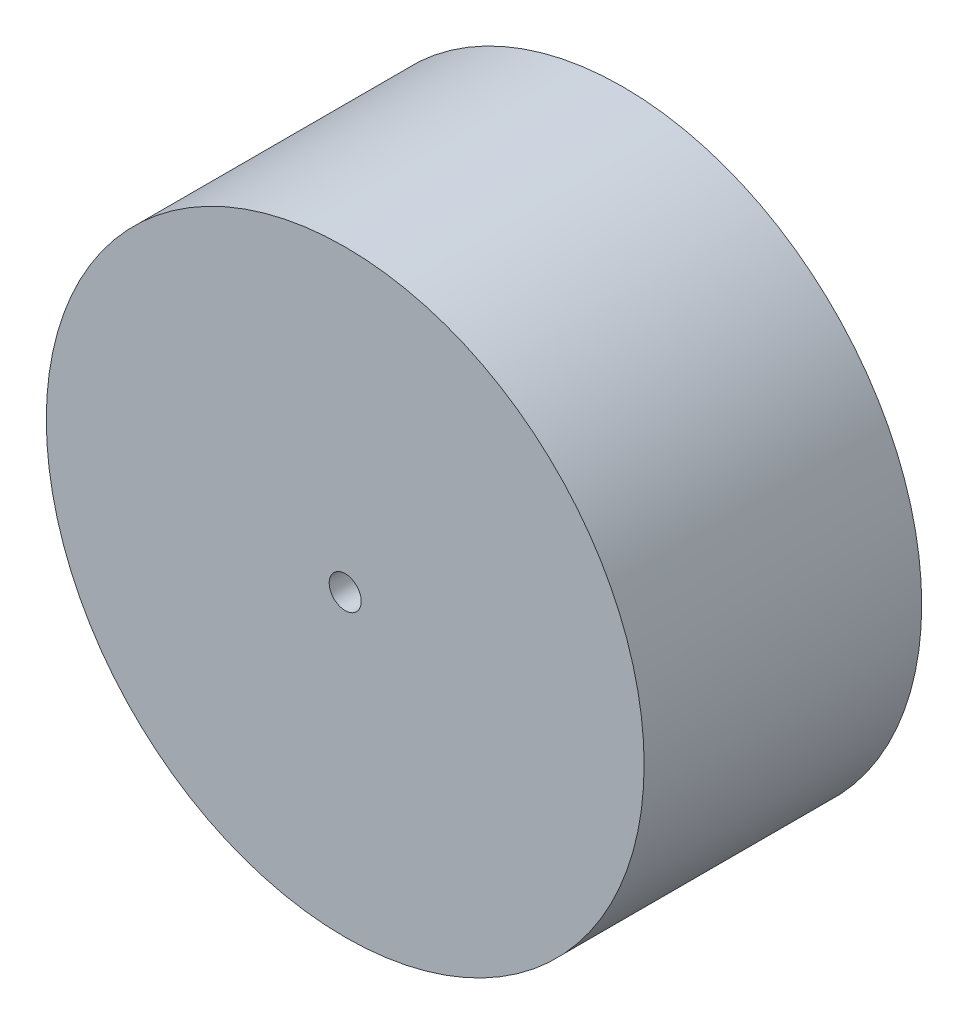
ISO-10303-21;
HEADER;
FILE_DESCRIPTION(('STEP AP214'),'2;1');
FILE_NAME('part.step','',(''),(''),'','','');
FILE_SCHEMA(('AUTOMOTIVE_DESIGN { 1 0 10303 214 1 1 1 1 }'));
ENDSEC;
DATA;
#1=APPLICATION_CONTEXT('core data for automotive mechanical design processes');
#2=APPLICATION_PROTOCOL_DEFINITION('international standard','automotive_design',2000,#1);
#3=PRODUCT_CONTEXT('',#1,'mechanical');
#4=PRODUCT('Part','Part','',(#3));
#5=PRODUCT_RELATED_PRODUCT_CATEGORY('part','',(#4));
#6=PRODUCT_DEFINITION_FORMATION('','',#4);
#7=PRODUCT_DEFINITION_CONTEXT('part definition',#1,'design');
#8=PRODUCT_DEFINITION('design','',#6,#7);
#9=PRODUCT_DEFINITION_SHAPE('','',#8);
#10=(LENGTH_UNIT() NAMED_UNIT(*) SI_UNIT(.MILLI.,.METRE.));
#11=(NAMED_UNIT(*) PLANE_ANGLE_UNIT() SI_UNIT($,.RADIAN.));
#12=(NAMED_UNIT(*) SI_UNIT($,.STERADIAN.) SOLID_ANGLE_UNIT());
#13=UNCERTAINTY_MEASURE_WITH_UNIT(LENGTH_MEASURE(1.E-05),#10,'distance_accuracy_value','');
#14=(GEOMETRIC_REPRESENTATION_CONTEXT(3) GLOBAL_UNCERTAINTY_ASSIGNED_CONTEXT((#13)) GLOBAL_UNIT_ASSIGNED_CONTEXT((#10,
#11,#12)) REPRESENTATION_CONTEXT('',''));
#15=CARTESIAN_POINT('',(0.,0.,0.));
#16=DIRECTION('',(0.,0.,1.));
#17=DIRECTION('',(1.,0.,0.));
#18=AXIS2_PLACEMENT_3D('',#15,#16,#17);
#19=CARTESIAN_POINT('',(0.,0.,26.));
#20=DIRECTION('',(0.,0.,1.));
#21=DIRECTION('',(1.,0.,0.));
#22=AXIS2_PLACEMENT_3D('',#19,#20,#21);
#23=PLANE('',#22);
#24=CARTESIAN_POINT('',(0.,0.,26.));
#25=DIRECTION('',(0.,0.,1.));
#26=DIRECTION('',(1.,0.,0.));
#27=AXIS2_PLACEMENT_3D('',#24,#25,#26);
#28=CIRCLE('',#27,28.);
#29=CARTESIAN_POINT('',(28.,0.,26.));
#30=VERTEX_POINT('',#29);
#31=EDGE_CURVE('E10',#30,#30,#28,.T.);
#32=ORIENTED_EDGE('',*,*,#31,.T.);
#33=EDGE_LOOP('',(#32));
#34=FACE_BOUND('',#33,.T.);
#35=CARTESIAN_POINT('',(0.,0.,26.));
#36=DIRECTION('',(0.,0.,1.));
#37=DIRECTION('',(1.,0.,0.));
#38=AXIS2_PLACEMENT_3D('',#35,#36,#37);
#39=CIRCLE('',#38,1.5);
#40=CARTESIAN_POINT('',(1.5,0.,26.));
#41=VERTEX_POINT('',#40);
#42=EDGE_CURVE('E46',#41,#41,#39,.T.);
#43=ORIENTED_EDGE('',*,*,#42,.F.);
#44=EDGE_LOOP('',(#43));
#45=FACE_BOUND('',#44,.T.);
#46=ADVANCED_FACE('F35',(#34,#45),#23,.T.);
#47=CARTESIAN_POINT('',(0.,0.,0.));
#48=DIRECTION('',(0.,0.,1.));
#49=DIRECTION('',(1.,0.,0.));
#50=AXIS2_PLACEMENT_3D('',#47,#48,#49);
#51=PLANE('',#50);
#52=CARTESIAN_POINT('',(0.,0.,0.));
#53=DIRECTION('',(0.,0.,1.));
#54=DIRECTION('',(1.,0.,0.));
#55=AXIS2_PLACEMENT_3D('',#52,#53,#54);
#56=CIRCLE('',#55,28.);
#57=CARTESIAN_POINT('',(28.,0.,0.));
#58=VERTEX_POINT('',#57);
#59=EDGE_CURVE('E39',#58,#58,#56,.T.);
#60=ORIENTED_EDGE('',*,*,#59,.F.);
#61=EDGE_LOOP('',(#60));
#62=FACE_BOUND('',#61,.T.);
#63=CARTESIAN_POINT('',(0.,0.,0.));
#64=DIRECTION('',(0.,0.,1.));
#65=DIRECTION('',(1.,0.,0.));
#66=AXIS2_PLACEMENT_3D('',#63,#64,#65);
#67=CIRCLE('',#66,1.5);
#68=CARTESIAN_POINT('',(1.5,0.,0.));
#69=VERTEX_POINT('',#68);
#70=EDGE_CURVE('E48',#69,#69,#67,.T.);
#71=ORIENTED_EDGE('',*,*,#70,.T.);
#72=EDGE_LOOP('',(#71));
#73=FACE_BOUND('',#72,.T.);
#74=ADVANCED_FACE('F58',(#62,#73),#51,.F.);
#75=CARTESIAN_POINT('',(0.,0.,26.));
#76=DIRECTION('',(0.,0.,-1.));
#77=DIRECTION('',(-1.,0.,0.));
#78=AXIS2_PLACEMENT_3D('',#75,#76,#77);
#79=CYLINDRICAL_SURFACE('',#78,28.);
#80=ORIENTED_EDGE('',*,*,#31,.F.);
#81=EDGE_LOOP('',(#80));
#82=FACE_BOUND('',#81,.T.);
#83=ORIENTED_EDGE('',*,*,#59,.T.);
#84=EDGE_LOOP('',(#83));
#85=FACE_BOUND('',#84,.T.);
#86=ADVANCED_FACE('F37',(#82,#85),#79,.T.);
#87=CARTESIAN_POINT('',(0.,0.,26.));
#88=DIRECTION('',(0.,0.,-1.));
#89=DIRECTION('',(-1.,0.,0.));
#90=AXIS2_PLACEMENT_3D('',#87,#88,#89);
#91=CYLINDRICAL_SURFACE('',#90,1.5);
#92=ORIENTED_EDGE('',*,*,#42,.T.);
#93=EDGE_LOOP('',(#92));
#94=FACE_BOUND('',#93,.T.);
#95=ORIENTED_EDGE('',*,*,#70,.F.);
#96=EDGE_LOOP('',(#95));
#97=FACE_BOUND('',#96,.T.);
#98=ADVANCED_FACE('F54',(#94,#97),#91,.F.);
#99=CLOSED_SHELL('',(#46,#74,#86,#98));
#100=MANIFOLD_SOLID_BREP('B2',#99);
#101=ADVANCED_BREP_SHAPE_REPRESENTATION('',(#18,#100),#14);
#102=SHAPE_DEFINITION_REPRESENTATION(#9,#101);
ENDSEC;
END-ISO-10303-21;
